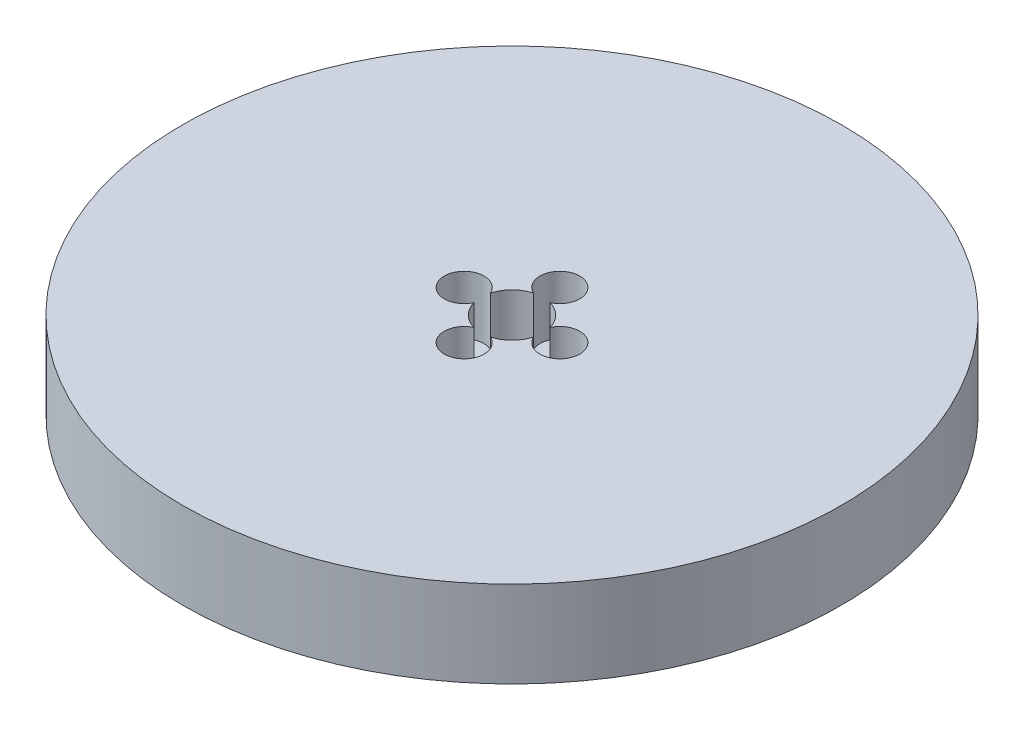
ISO-10303-21;
HEADER;
FILE_DESCRIPTION(('STEP AP214'),'2;1');
FILE_NAME('part.step','',(''),(''),'','','');
FILE_SCHEMA(('AUTOMOTIVE_DESIGN { 1 0 10303 214 1 1 1 1 }'));
ENDSEC;
DATA;
#1=APPLICATION_CONTEXT('core data for automotive mechanical design processes');
#2=APPLICATION_PROTOCOL_DEFINITION('international standard','automotive_design',2000,#1);
#3=PRODUCT_CONTEXT('',#1,'mechanical');
#4=PRODUCT('Part','Part','',(#3));
#5=PRODUCT_RELATED_PRODUCT_CATEGORY('part','',(#4));
#6=PRODUCT_DEFINITION_FORMATION('','',#4);
#7=PRODUCT_DEFINITION_CONTEXT('part definition',#1,'design');
#8=PRODUCT_DEFINITION('design','',#6,#7);
#9=PRODUCT_DEFINITION_SHAPE('','',#8);
#10=(LENGTH_UNIT() NAMED_UNIT(*) SI_UNIT(.MILLI.,.METRE.));
#11=(NAMED_UNIT(*) PLANE_ANGLE_UNIT() SI_UNIT($,.RADIAN.));
#12=(NAMED_UNIT(*) SI_UNIT($,.STERADIAN.) SOLID_ANGLE_UNIT());
#13=UNCERTAINTY_MEASURE_WITH_UNIT(LENGTH_MEASURE(1.E-05),#10,'distance_accuracy_value','');
#14=(GEOMETRIC_REPRESENTATION_CONTEXT(3) GLOBAL_UNCERTAINTY_ASSIGNED_CONTEXT((#13)) GLOBAL_UNIT_ASSIGNED_CONTEXT((#10,
#11,#12)) REPRESENTATION_CONTEXT('',''));
#15=CARTESIAN_POINT('',(0.,0.,0.));
#16=DIRECTION('',(0.,0.,1.));
#17=DIRECTION('',(1.,0.,0.));
#18=AXIS2_PLACEMENT_3D('',#15,#16,#17);
#19=CARTESIAN_POINT('',(0.,21.,0.));
#20=DIRECTION('',(0.,-1.,0.));
#21=DIRECTION('',(0.,0.,-1.));
#22=AXIS2_PLACEMENT_3D('',#19,#20,#21);
#23=CYLINDRICAL_SURFACE('',#22,80.);
#24=CARTESIAN_POINT('',(0.,21.,0.));
#25=DIRECTION('',(0.,1.,0.));
#26=DIRECTION('',(0.,0.,1.));
#27=AXIS2_PLACEMENT_3D('',#24,#25,#26);
#28=CIRCLE('',#27,80.);
#29=CARTESIAN_POINT('',(0.,21.,-80.));
#30=VERTEX_POINT('',#29);
#31=EDGE_CURVE('E145',#30,#30,#28,.T.);
#32=CARTESIAN_POINT('',(0.,0.,0.));
#33=DIRECTION('',(0.,1.,0.));
#34=DIRECTION('',(0.,0.,1.));
#35=AXIS2_PLACEMENT_3D('',#32,#33,#34);
#36=CIRCLE('',#35,80.);
#37=CARTESIAN_POINT('',(0.,0.,-80.));
#38=VERTEX_POINT('',#37);
#39=EDGE_CURVE('E143',#38,#38,#36,.T.);
#40=CARTESIAN_POINT('',(0.,21.,-80.));
#41=CARTESIAN_POINT('',(0.,20.78125,-80.));
#42=CARTESIAN_POINT('',(0.,20.5625,-80.));
#43=CARTESIAN_POINT('',(0.,20.125,-80.));
#44=CARTESIAN_POINT('',(0.,19.90625,-80.));
#45=CARTESIAN_POINT('',(0.,19.46875,-80.));
#46=CARTESIAN_POINT('',(0.,19.25,-80.));
#47=CARTESIAN_POINT('',(0.,18.8125,-80.));
#48=CARTESIAN_POINT('',(0.,18.59375,-80.));
#49=CARTESIAN_POINT('',(0.,18.15625,-80.));
#50=CARTESIAN_POINT('',(0.,17.9375,-80.));
#51=CARTESIAN_POINT('',(0.,17.5,-80.));
#52=CARTESIAN_POINT('',(0.,17.28125,-80.));
#53=CARTESIAN_POINT('',(0.,16.84375,-80.));
#54=CARTESIAN_POINT('',(0.,16.625,-80.));
#55=CARTESIAN_POINT('',(0.,16.1875,-80.));
#56=CARTESIAN_POINT('',(0.,15.96875,-80.));
#57=CARTESIAN_POINT('',(0.,15.53125,-80.));
#58=CARTESIAN_POINT('',(0.,15.3125,-80.));
#59=CARTESIAN_POINT('',(0.,14.875,-80.));
#60=CARTESIAN_POINT('',(0.,14.65625,-80.));
#61=CARTESIAN_POINT('',(0.,14.21875,-80.));
#62=CARTESIAN_POINT('',(0.,14.,-80.));
#63=CARTESIAN_POINT('',(0.,13.5625,-80.));
#64=CARTESIAN_POINT('',(0.,13.34375,-80.));
#65=CARTESIAN_POINT('',(0.,12.90625,-80.));
#66=CARTESIAN_POINT('',(0.,12.6875,-80.));
#67=CARTESIAN_POINT('',(0.,12.25,-80.));
#68=CARTESIAN_POINT('',(0.,12.03125,-80.));
#69=CARTESIAN_POINT('',(0.,11.59375,-80.));
#70=CARTESIAN_POINT('',(0.,11.375,-80.));
#71=CARTESIAN_POINT('',(0.,10.9375,-80.));
#72=CARTESIAN_POINT('',(0.,10.71875,-80.));
#73=CARTESIAN_POINT('',(0.,10.28125,-80.));
#74=CARTESIAN_POINT('',(0.,10.0625,-80.));
#75=CARTESIAN_POINT('',(0.,9.625,-80.));
#76=CARTESIAN_POINT('',(0.,9.40625,-80.));
#77=CARTESIAN_POINT('',(0.,8.96875,-80.));
#78=CARTESIAN_POINT('',(0.,8.75,-80.));
#79=CARTESIAN_POINT('',(0.,8.3125,-80.));
#80=CARTESIAN_POINT('',(0.,8.09375,-80.));
#81=CARTESIAN_POINT('',(0.,7.65625,-80.));
#82=CARTESIAN_POINT('',(0.,7.4375,-80.));
#83=CARTESIAN_POINT('',(0.,7.,-80.));
#84=CARTESIAN_POINT('',(0.,6.78125,-80.));
#85=CARTESIAN_POINT('',(0.,6.34375,-80.));
#86=CARTESIAN_POINT('',(0.,6.125,-80.));
#87=CARTESIAN_POINT('',(0.,5.6875,-80.));
#88=CARTESIAN_POINT('',(0.,5.46875,-80.));
#89=CARTESIAN_POINT('',(0.,5.03125,-80.));
#90=CARTESIAN_POINT('',(0.,4.8125,-80.));
#91=CARTESIAN_POINT('',(0.,4.375,-80.));
#92=CARTESIAN_POINT('',(0.,4.15625,-80.));
#93=CARTESIAN_POINT('',(0.,3.71875,-80.));
#94=CARTESIAN_POINT('',(0.,3.5,-80.));
#95=CARTESIAN_POINT('',(0.,3.0625,-80.));
#96=CARTESIAN_POINT('',(0.,2.84375,-80.));
#97=CARTESIAN_POINT('',(0.,2.40625,-80.));
#98=CARTESIAN_POINT('',(0.,2.1875,-80.));
#99=CARTESIAN_POINT('',(0.,1.75,-80.));
#100=CARTESIAN_POINT('',(0.,1.53125,-80.));
#101=CARTESIAN_POINT('',(0.,1.09375,-80.));
#102=CARTESIAN_POINT('',(0.,0.875000000000001,-80.));
#103=CARTESIAN_POINT('',(0.,0.4375,-80.));
#104=CARTESIAN_POINT('',(0.,0.21875,-80.));
#105=CARTESIAN_POINT('',(0.,0.,-80.));
#106=B_SPLINE_CURVE_WITH_KNOTS('',3,(#40,#41,#42,#43,#44,#45,#46,#47,#48,#49,#50,#51,#52,#53,
#54,#55,#56,#57,#58,#59,#60,#61,#62,#63,#64,#65,#66,#67,#68,#69,#70,#71,#72,#73,#74,#75,#76,#77,
#78,#79,#80,#81,#82,#83,#84,#85,#86,#87,#88,#89,#90,#91,#92,#93,#94,#95,#96,#97,#98,#99,#100,
#101,#102,#103,#104,#105),.UNSPECIFIED.,.F.,.F.,(4,2,2,2,2,2,2,2,2,2,2,2,2,2,2,2,2,2,2,2,2,2,2,
2,2,2,2,2,2,2,2,2,4),(0.,0.656250000000001,1.3125,1.96875,2.625,3.28125,3.9375,4.59375,5.25,
5.90625,6.5625,7.21875,7.875,8.53125,9.1875,9.84375,10.5,11.15625,11.8125,12.46875,13.125,
13.78125,14.4375,15.09375,15.75,16.40625,17.0625,17.71875,18.375,19.03125,19.6875,20.34375,21.),.UNSPECIFIED.);
#107=EDGE_CURVE('BSEAM39',#30,#38,#106,.T.);
#108=ORIENTED_EDGE('',*,*,#31,.F.);
#109=ORIENTED_EDGE('',*,*,#39,.T.);
#110=ORIENTED_EDGE('',*,*,#107,.T.);
#111=ORIENTED_EDGE('',*,*,#107,.F.);
#112=EDGE_LOOP('',(#108,#110,#109,#111));
#113=FACE_BOUND('',#112,.T.);
#114=ADVANCED_FACE('F39',(#113),#23,.T.);
#115=CARTESIAN_POINT('',(0.,21.,0.));
#116=DIRECTION('',(0.,1.,0.));
#117=DIRECTION('',(0.,0.,1.));
#118=AXIS2_PLACEMENT_3D('',#115,#116,#117);
#119=PLANE('',#118);
#120=CARTESIAN_POINT('',(0.,21.,11.6083151069299));
#121=DIRECTION('',(0.,1.,0.));
#122=DIRECTION('',(1.,0.,0.));
#123=AXIS2_PLACEMENT_3D('',#120,#121,#122);
#124=CIRCLE('',#123,4.81969668179618);
#125=CARTESIAN_POINT('',(-2.00714120138498,21.,7.2264364798774));
#126=VERTEX_POINT('',#125);
#127=CARTESIAN_POINT('',(2.00714120138503,21.,7.22643647987739));
#128=VERTEX_POINT('',#127);
#129=EDGE_CURVE('E152',#126,#128,#124,.T.);
#130=ORIENTED_EDGE('',*,*,#129,.F.);
#131=CARTESIAN_POINT('',(0.,21.,0.));
#132=DIRECTION('',(0.,1.,0.));
#133=DIRECTION('',(0.,0.,1.));
#134=AXIS2_PLACEMENT_3D('',#131,#132,#133);
#135=CIRCLE('',#134,7.5);
#136=CARTESIAN_POINT('',(-7.22643647987739,21.,2.007141201385));
#137=VERTEX_POINT('',#136);
#138=EDGE_CURVE('E133',#137,#126,#135,.T.);
#139=ORIENTED_EDGE('',*,*,#138,.F.);
#140=CARTESIAN_POINT('',(-11.6083151069299,21.,0.));
#141=DIRECTION('',(0.,1.,0.));
#142=DIRECTION('',(0.,0.,1.));
#143=AXIS2_PLACEMENT_3D('',#140,#141,#142);
#144=CIRCLE('',#143,4.81969668179618);
#145=CARTESIAN_POINT('',(-7.22643647987739,21.,-2.007141201385));
#146=VERTEX_POINT('',#145);
#147=EDGE_CURVE('E128',#146,#137,#144,.T.);
#148=ORIENTED_EDGE('',*,*,#147,.F.);
#149=CARTESIAN_POINT('',(-2.00714120138508,21.,-7.22643647987737));
#150=VERTEX_POINT('',#149);
#151=EDGE_CURVE('E121',#150,#146,#135,.T.);
#152=ORIENTED_EDGE('',*,*,#151,.F.);
#153=CARTESIAN_POINT('',(-1.2159064671377E-13,21.,-11.6083151069299));
#154=DIRECTION('',(0.,1.,0.));
#155=DIRECTION('',(-1.,0.,0.));
#156=AXIS2_PLACEMENT_3D('',#153,#154,#155);
#157=CIRCLE('',#156,4.81969668179618);
#158=CARTESIAN_POINT('',(2.00714120138493,21.,-7.22643647987741));
#159=VERTEX_POINT('',#158);
#160=EDGE_CURVE('E105',#159,#150,#157,.T.);
#161=ORIENTED_EDGE('',*,*,#160,.F.);
#162=CARTESIAN_POINT('',(7.22643647987739,21.,-2.007141201385));
#163=VERTEX_POINT('',#162);
#164=EDGE_CURVE('E131',#163,#159,#135,.T.);
#165=ORIENTED_EDGE('',*,*,#164,.F.);
#166=CARTESIAN_POINT('',(11.6083151069299,21.,0.));
#167=DIRECTION('',(0.,1.,0.));
#168=DIRECTION('',(0.,0.,-1.));
#169=AXIS2_PLACEMENT_3D('',#166,#167,#168);
#170=CIRCLE('',#169,4.81969668179618);
#171=CARTESIAN_POINT('',(7.22643647987739,21.,2.007141201385));
#172=VERTEX_POINT('',#171);
#173=EDGE_CURVE('E154',#172,#163,#170,.T.);
#174=ORIENTED_EDGE('',*,*,#173,.F.);
#175=EDGE_CURVE('E134',#128,#172,#135,.T.);
#176=ORIENTED_EDGE('',*,*,#175,.F.);
#177=EDGE_LOOP('',(#130,#139,#148,#152,#161,#165,#174,#176));
#178=FACE_BOUND('',#177,.T.);
#179=ORIENTED_EDGE('',*,*,#31,.T.);
#180=EDGE_LOOP('',(#179));
#181=FACE_BOUND('',#180,.T.);
#182=ADVANCED_FACE('F130',(#178,#181),#119,.T.);
#183=CARTESIAN_POINT('',(0.,0.,0.));
#184=DIRECTION('',(0.,1.,0.));
#185=DIRECTION('',(0.,0.,1.));
#186=AXIS2_PLACEMENT_3D('',#183,#184,#185);
#187=PLANE('',#186);
#188=CARTESIAN_POINT('',(0.,0.,0.));
#189=DIRECTION('',(0.,1.,0.));
#190=DIRECTION('',(0.,0.,1.));
#191=AXIS2_PLACEMENT_3D('',#188,#189,#190);
#192=CIRCLE('',#191,7.5);
#193=CARTESIAN_POINT('',(0.,0.,7.5));
#194=VERTEX_POINT('',#193);
#195=EDGE_CURVE('E135',#194,#194,#192,.T.);
#196=ORIENTED_EDGE('',*,*,#195,.T.);
#197=EDGE_LOOP('',(#196));
#198=FACE_BOUND('',#197,.T.);
#199=ORIENTED_EDGE('',*,*,#39,.F.);
#200=EDGE_LOOP('',(#199));
#201=FACE_BOUND('',#200,.T.);
#202=ADVANCED_FACE('F195',(#198,#201),#187,.F.);
#203=CARTESIAN_POINT('',(0.,21.,0.));
#204=DIRECTION('',(0.,-1.,0.));
#205=DIRECTION('',(0.,0.,-1.));
#206=AXIS2_PLACEMENT_3D('',#203,#204,#205);
#207=CYLINDRICAL_SURFACE('',#206,7.5);
#208=DIRECTION('',(0.,1.,0.));
#209=VECTOR('',#208,1.);
#210=CARTESIAN_POINT('',(-2.00714120138498,13.8911120662501,7.2264364798774));
#211=LINE('',#210,#209);
#212=CARTESIAN_POINT('',(-2.00714120138498,6.78222413250021,7.2264364798774));
#213=VERTEX_POINT('',#212);
#214=EDGE_CURVE('E11',#213,#126,#211,.T.);
#215=ORIENTED_EDGE('',*,*,#214,.F.);
#216=CARTESIAN_POINT('',(0.,6.78222413250021,0.));
#217=DIRECTION('',(0.,1.,0.));
#218=DIRECTION('',(0.,0.,1.));
#219=AXIS2_PLACEMENT_3D('',#216,#217,#218);
#220=CIRCLE('',#219,7.5);
#221=CARTESIAN_POINT('',(2.00714120138503,6.78222413250021,7.22643647987739));
#222=VERTEX_POINT('',#221);
#223=EDGE_CURVE('E169',#213,#222,#220,.T.);
#224=ORIENTED_EDGE('',*,*,#223,.T.);
#225=DIRECTION('',(0.,1.,0.));
#226=VECTOR('',#225,1.);
#227=CARTESIAN_POINT('',(2.00714120138503,13.8911120662501,7.22643647987739));
#228=LINE('',#227,#226);
#229=EDGE_CURVE('E46',#128,#222,#228,.F.);
#230=ORIENTED_EDGE('',*,*,#229,.F.);
#231=ORIENTED_EDGE('',*,*,#175,.T.);
#232=DIRECTION('',(0.,1.,0.));
#233=VECTOR('',#232,1.);
#234=CARTESIAN_POINT('',(7.22643647987739,13.8911120662501,2.007141201385));
#235=LINE('',#234,#233);
#236=CARTESIAN_POINT('',(7.22643647987739,6.78222413250021,2.007141201385));
#237=VERTEX_POINT('',#236);
#238=EDGE_CURVE('E151',#237,#172,#235,.T.);
#239=ORIENTED_EDGE('',*,*,#238,.F.);
#240=CARTESIAN_POINT('',(0.,6.78222413250021,0.));
#241=DIRECTION('',(0.,1.,0.));
#242=DIRECTION('',(0.,0.,1.));
#243=AXIS2_PLACEMENT_3D('',#240,#241,#242);
#244=CIRCLE('',#243,7.5);
#245=CARTESIAN_POINT('',(7.22643647987739,6.78222413250021,-2.007141201385));
#246=VERTEX_POINT('',#245);
#247=EDGE_CURVE('E173',#237,#246,#244,.T.);
#248=ORIENTED_EDGE('',*,*,#247,.T.);
#249=DIRECTION('',(0.,1.,0.));
#250=VECTOR('',#249,1.);
#251=CARTESIAN_POINT('',(7.22643647987739,13.8911120662501,-2.007141201385));
#252=LINE('',#251,#250);
#253=EDGE_CURVE('E168',#163,#246,#252,.F.);
#254=ORIENTED_EDGE('',*,*,#253,.F.);
#255=ORIENTED_EDGE('',*,*,#164,.T.);
#256=DIRECTION('',(0.,1.,0.));
#257=VECTOR('',#256,1.);
#258=CARTESIAN_POINT('',(2.00714120138493,13.8911120662501,-7.22643647987741));
#259=LINE('',#258,#257);
#260=CARTESIAN_POINT('',(2.00714120138493,6.78222413250021,-7.22643647987741));
#261=VERTEX_POINT('',#260);
#262=EDGE_CURVE('E108',#261,#159,#259,.T.);
#263=ORIENTED_EDGE('',*,*,#262,.F.);
#264=CARTESIAN_POINT('',(0.,6.78222413250021,0.));
#265=DIRECTION('',(0.,1.,0.));
#266=DIRECTION('',(0.,0.,1.));
#267=AXIS2_PLACEMENT_3D('',#264,#265,#266);
#268=CIRCLE('',#267,7.5);
#269=CARTESIAN_POINT('',(-2.00714120138508,6.78222413250021,-7.22643647987737));
#270=VERTEX_POINT('',#269);
#271=EDGE_CURVE('E122',#261,#270,#268,.T.);
#272=ORIENTED_EDGE('',*,*,#271,.T.);
#273=DIRECTION('',(0.,1.,0.));
#274=VECTOR('',#273,1.);
#275=CARTESIAN_POINT('',(-2.00714120138508,13.8911120662501,-7.22643647987737));
#276=LINE('',#275,#274);
#277=EDGE_CURVE('E106',#150,#270,#276,.F.);
#278=ORIENTED_EDGE('',*,*,#277,.F.);
#279=ORIENTED_EDGE('',*,*,#151,.T.);
#280=DIRECTION('',(0.,1.,0.));
#281=VECTOR('',#280,1.);
#282=CARTESIAN_POINT('',(-7.22643647987739,13.8911120662501,-2.007141201385));
#283=LINE('',#282,#281);
#284=CARTESIAN_POINT('',(-7.22643647987739,6.78222413250021,-2.007141201385));
#285=VERTEX_POINT('',#284);
#286=EDGE_CURVE('E177',#285,#146,#283,.T.);
#287=ORIENTED_EDGE('',*,*,#286,.F.);
#288=CARTESIAN_POINT('',(0.,6.78222413250021,0.));
#289=DIRECTION('',(0.,1.,0.));
#290=DIRECTION('',(0.,0.,1.));
#291=AXIS2_PLACEMENT_3D('',#288,#289,#290);
#292=CIRCLE('',#291,7.5);
#293=CARTESIAN_POINT('',(-7.22643647987739,6.78222413250021,2.007141201385));
#294=VERTEX_POINT('',#293);
#295=EDGE_CURVE('E185',#285,#294,#292,.T.);
#296=ORIENTED_EDGE('',*,*,#295,.T.);
#297=DIRECTION('',(0.,1.,0.));
#298=VECTOR('',#297,1.);
#299=CARTESIAN_POINT('',(-7.22643647987739,13.8911120662501,2.007141201385));
#300=LINE('',#299,#298);
#301=EDGE_CURVE('E179',#137,#294,#300,.F.);
#302=ORIENTED_EDGE('',*,*,#301,.F.);
#303=ORIENTED_EDGE('',*,*,#138,.T.);
#304=EDGE_LOOP('',(#215,#224,#230,#231,#239,#248,#254,#255,#263,#272,#278,#279,#287,#296,#302,#303));
#305=FACE_BOUND('',#304,.T.);
#306=ORIENTED_EDGE('',*,*,#195,.F.);
#307=EDGE_LOOP('',(#306));
#308=FACE_BOUND('',#307,.T.);
#309=ADVANCED_FACE('F117',(#305,#308),#207,.F.);
#310=CARTESIAN_POINT('',(-11.6083151069299,6.78222413250021,0.));
#311=DIRECTION('',(0.,1.,0.));
#312=DIRECTION('',(0.,0.,1.));
#313=AXIS2_PLACEMENT_3D('',#310,#311,#312);
#314=CYLINDRICAL_SURFACE('',#313,4.81969668179618);
#315=ORIENTED_EDGE('',*,*,#286,.T.);
#316=ORIENTED_EDGE('',*,*,#147,.T.);
#317=ORIENTED_EDGE('',*,*,#301,.T.);
#318=CARTESIAN_POINT('',(-11.6083151069299,6.78222413250021,0.));
#319=DIRECTION('',(0.,1.,0.));
#320=DIRECTION('',(0.,0.,1.));
#321=AXIS2_PLACEMENT_3D('',#318,#319,#320);
#322=CIRCLE('',#321,4.81969668179618);
#323=EDGE_CURVE('E140',#285,#294,#322,.T.);
#324=ORIENTED_EDGE('',*,*,#323,.F.);
#325=EDGE_LOOP('',(#315,#316,#317,#324));
#326=FACE_BOUND('',#325,.T.);
#327=ADVANCED_FACE('F200',(#326),#314,.F.);
#328=CARTESIAN_POINT('',(-11.6083151069299,6.78222413250021,0.));
#329=DIRECTION('',(0.,1.,0.));
#330=DIRECTION('',(0.,0.,1.));
#331=AXIS2_PLACEMENT_3D('',#328,#329,#330);
#332=PLANE('',#331);
#333=ORIENTED_EDGE('',*,*,#323,.T.);
#334=ORIENTED_EDGE('',*,*,#295,.F.);
#335=EDGE_LOOP('',(#333,#334));
#336=FACE_BOUND('',#335,.T.);
#337=ADVANCED_FACE('F202',(#336),#332,.T.);
#338=CARTESIAN_POINT('',(-1.2159064671377E-13,6.78222413250021,-11.6083151069299));
#339=DIRECTION('',(0.,1.,0.));
#340=DIRECTION('',(0.,0.,1.));
#341=AXIS2_PLACEMENT_3D('',#338,#339,#340);
#342=CYLINDRICAL_SURFACE('',#341,4.81969668179618);
#343=ORIENTED_EDGE('',*,*,#262,.T.);
#344=ORIENTED_EDGE('',*,*,#160,.T.);
#345=ORIENTED_EDGE('',*,*,#277,.T.);
#346=CARTESIAN_POINT('',(-1.2159064671377E-13,6.78222413250021,-11.6083151069299));
#347=DIRECTION('',(0.,1.,0.));
#348=DIRECTION('',(-1.,0.,0.));
#349=AXIS2_PLACEMENT_3D('',#346,#347,#348);
#350=CIRCLE('',#349,4.81969668179618);
#351=EDGE_CURVE('E111',#261,#270,#350,.T.);
#352=ORIENTED_EDGE('',*,*,#351,.F.);
#353=EDGE_LOOP('',(#343,#344,#345,#352));
#354=FACE_BOUND('',#353,.T.);
#355=ADVANCED_FACE('F102',(#354),#342,.F.);
#356=CARTESIAN_POINT('',(-1.2159064671377E-13,6.78222413250021,-11.6083151069299));
#357=DIRECTION('',(0.,1.,0.));
#358=DIRECTION('',(-1.,0.,0.));
#359=AXIS2_PLACEMENT_3D('',#356,#357,#358);
#360=PLANE('',#359);
#361=ORIENTED_EDGE('',*,*,#351,.T.);
#362=ORIENTED_EDGE('',*,*,#271,.F.);
#363=EDGE_LOOP('',(#361,#362));
#364=FACE_BOUND('',#363,.T.);
#365=ADVANCED_FACE('F211',(#364),#360,.T.);
#366=CARTESIAN_POINT('',(11.6083151069299,6.78222413250021,0.));
#367=DIRECTION('',(0.,1.,0.));
#368=DIRECTION('',(0.,0.,1.));
#369=AXIS2_PLACEMENT_3D('',#366,#367,#368);
#370=CYLINDRICAL_SURFACE('',#369,4.81969668179618);
#371=ORIENTED_EDGE('',*,*,#238,.T.);
#372=ORIENTED_EDGE('',*,*,#173,.T.);
#373=ORIENTED_EDGE('',*,*,#253,.T.);
#374=CARTESIAN_POINT('',(11.6083151069299,6.78222413250021,0.));
#375=DIRECTION('',(0.,1.,0.));
#376=DIRECTION('',(0.,0.,-1.));
#377=AXIS2_PLACEMENT_3D('',#374,#375,#376);
#378=CIRCLE('',#377,4.81969668179618);
#379=EDGE_CURVE('E56',#237,#246,#378,.T.);
#380=ORIENTED_EDGE('',*,*,#379,.F.);
#381=EDGE_LOOP('',(#371,#372,#373,#380));
#382=FACE_BOUND('',#381,.T.);
#383=ADVANCED_FACE('F212',(#382),#370,.F.);
#384=CARTESIAN_POINT('',(11.6083151069299,6.78222413250021,0.));
#385=DIRECTION('',(0.,1.,0.));
#386=DIRECTION('',(0.,0.,-1.));
#387=AXIS2_PLACEMENT_3D('',#384,#385,#386);
#388=PLANE('',#387);
#389=ORIENTED_EDGE('',*,*,#379,.T.);
#390=ORIENTED_EDGE('',*,*,#247,.F.);
#391=EDGE_LOOP('',(#389,#390));
#392=FACE_BOUND('',#391,.T.);
#393=ADVANCED_FACE('F217',(#392),#388,.T.);
#394=CARTESIAN_POINT('',(0.,6.78222413250021,11.6083151069299));
#395=DIRECTION('',(0.,1.,0.));
#396=DIRECTION('',(0.,0.,1.));
#397=AXIS2_PLACEMENT_3D('',#394,#395,#396);
#398=CYLINDRICAL_SURFACE('',#397,4.81969668179618);
#399=ORIENTED_EDGE('',*,*,#214,.T.);
#400=ORIENTED_EDGE('',*,*,#129,.T.);
#401=ORIENTED_EDGE('',*,*,#229,.T.);
#402=CARTESIAN_POINT('',(0.,6.78222413250021,11.6083151069299));
#403=DIRECTION('',(0.,1.,0.));
#404=DIRECTION('',(1.,0.,0.));
#405=AXIS2_PLACEMENT_3D('',#402,#403,#404);
#406=CIRCLE('',#405,4.81969668179618);
#407=EDGE_CURVE('E55',#213,#222,#406,.T.);
#408=ORIENTED_EDGE('',*,*,#407,.F.);
#409=EDGE_LOOP('',(#399,#400,#401,#408));
#410=FACE_BOUND('',#409,.T.);
#411=ADVANCED_FACE('F170',(#410),#398,.F.);
#412=CARTESIAN_POINT('',(0.,6.78222413250021,11.6083151069299));
#413=DIRECTION('',(0.,1.,0.));
#414=DIRECTION('',(1.,0.,0.));
#415=AXIS2_PLACEMENT_3D('',#412,#413,#414);
#416=PLANE('',#415);
#417=ORIENTED_EDGE('',*,*,#407,.T.);
#418=ORIENTED_EDGE('',*,*,#223,.F.);
#419=EDGE_LOOP('',(#417,#418));
#420=FACE_BOUND('',#419,.T.);
#421=ADVANCED_FACE('F224',(#420),#416,.T.);
#422=CLOSED_SHELL('',(#114,#182,#202,#309,#327,#337,#355,#365,#383,#393,#411,#421));
#423=MANIFOLD_SOLID_BREP('B2',#422);
#424=ADVANCED_BREP_SHAPE_REPRESENTATION('',(#18,#423),#14);
#425=SHAPE_DEFINITION_REPRESENTATION(#9,#424);
ENDSEC;
END-ISO-10303-21;
